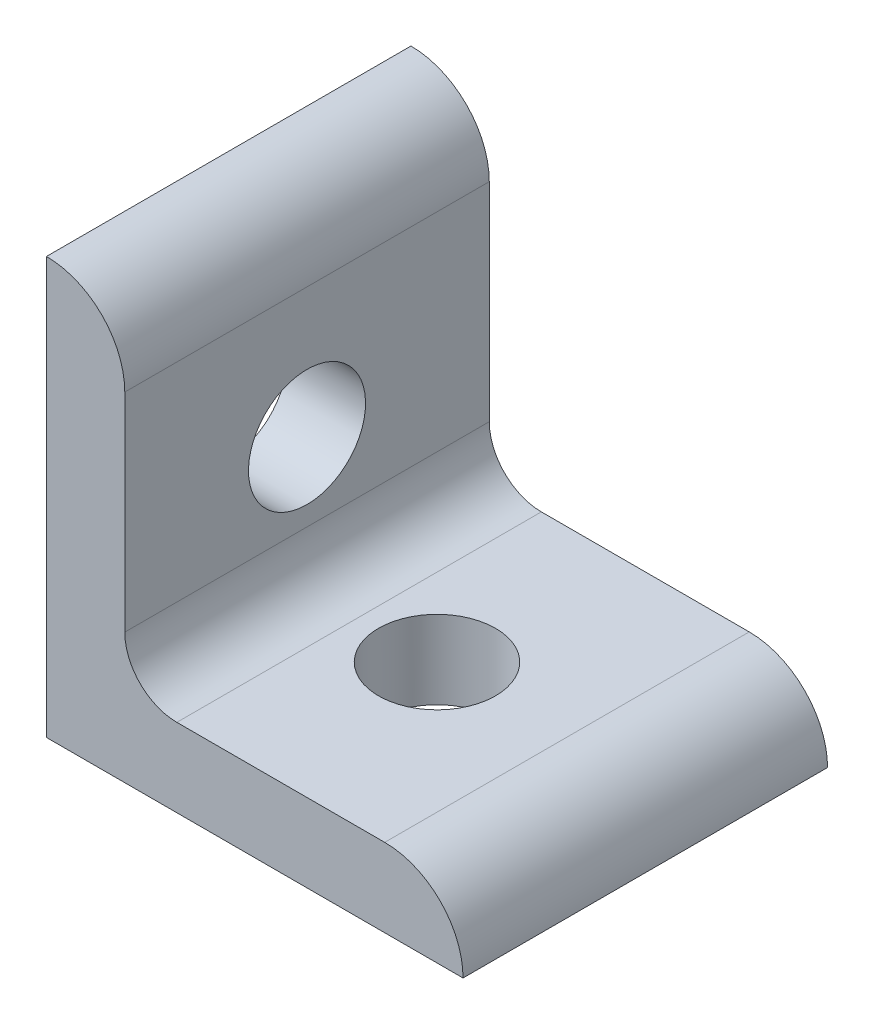
ISO-10303-21;
HEADER;
FILE_DESCRIPTION(('STEP AP214'),'2;1');
FILE_NAME('part.step','',(''),(''),'','','');
FILE_SCHEMA(('AUTOMOTIVE_DESIGN { 1 0 10303 214 1 1 1 1 }'));
ENDSEC;
DATA;
#1=APPLICATION_CONTEXT('core data for automotive mechanical design processes');
#2=APPLICATION_PROTOCOL_DEFINITION('international standard','automotive_design',2000,#1);
#3=PRODUCT_CONTEXT('',#1,'mechanical');
#4=PRODUCT('Part','Part','',(#3));
#5=PRODUCT_RELATED_PRODUCT_CATEGORY('part','',(#4));
#6=PRODUCT_DEFINITION_FORMATION('','',#4);
#7=PRODUCT_DEFINITION_CONTEXT('part definition',#1,'design');
#8=PRODUCT_DEFINITION('design','',#6,#7);
#9=PRODUCT_DEFINITION_SHAPE('','',#8);
#10=(LENGTH_UNIT() NAMED_UNIT(*) SI_UNIT(.MILLI.,.METRE.));
#11=(NAMED_UNIT(*) PLANE_ANGLE_UNIT() SI_UNIT($,.RADIAN.));
#12=(NAMED_UNIT(*) SI_UNIT($,.STERADIAN.) SOLID_ANGLE_UNIT());
#13=UNCERTAINTY_MEASURE_WITH_UNIT(LENGTH_MEASURE(1.E-05),#10,'distance_accuracy_value','');
#14=(GEOMETRIC_REPRESENTATION_CONTEXT(3) GLOBAL_UNCERTAINTY_ASSIGNED_CONTEXT((#13)) GLOBAL_UNIT_ASSIGNED_CONTEXT((#10,
#11,#12)) REPRESENTATION_CONTEXT('',''));
#15=CARTESIAN_POINT('',(0.,0.,0.));
#16=DIRECTION('',(0.,0.,1.));
#17=DIRECTION('',(1.,0.,0.));
#18=AXIS2_PLACEMENT_3D('',#15,#16,#17);
#19=CARTESIAN_POINT('',(4.7752,20.6248,11.1125));
#20=DIRECTION('',(-1.,0.,0.));
#21=DIRECTION('',(0.,-1.,0.));
#22=AXIS2_PLACEMENT_3D('',#19,#20,#21);
#23=PLANE('',#22);
#24=DIRECTION('',(0.,1.,0.));
#25=VECTOR('',#24,1.);
#26=CARTESIAN_POINT('',(4.7752,20.6248,-11.1125));
#27=LINE('',#26,#25);
#28=CARTESIAN_POINT('',(4.7752,7.9502,-11.1125));
#29=VERTEX_POINT('',#28);
#30=CARTESIAN_POINT('',(4.7752,20.6248,-11.1125));
#31=VERTEX_POINT('',#30);
#32=EDGE_CURVE('E114',#29,#31,#27,.T.);
#33=ORIENTED_EDGE('',*,*,#32,.T.);
#34=DIRECTION('',(0.,0.,-1.));
#35=VECTOR('',#34,1.);
#36=CARTESIAN_POINT('',(4.7752,20.6248,11.1125));
#37=LINE('',#36,#35);
#38=CARTESIAN_POINT('',(4.7752,20.6248,11.1125));
#39=VERTEX_POINT('',#38);
#40=EDGE_CURVE('E111',#39,#31,#37,.T.);
#41=ORIENTED_EDGE('',*,*,#40,.F.);
#42=DIRECTION('',(0.,1.,0.));
#43=VECTOR('',#42,1.);
#44=CARTESIAN_POINT('',(4.7752,20.6248,11.1125));
#45=LINE('',#44,#43);
#46=CARTESIAN_POINT('',(4.7752,7.9502,11.1125));
#47=VERTEX_POINT('',#46);
#48=EDGE_CURVE('E100',#47,#39,#45,.T.);
#49=ORIENTED_EDGE('',*,*,#48,.F.);
#50=DIRECTION('',(0.,0.,-1.));
#51=VECTOR('',#50,1.);
#52=CARTESIAN_POINT('',(4.7752,7.9502,11.1125));
#53=LINE('',#52,#51);
#54=EDGE_CURVE('E115',#47,#29,#53,.T.);
#55=ORIENTED_EDGE('',*,*,#54,.T.);
#56=EDGE_LOOP('',(#33,#41,#49,#55));
#57=FACE_BOUND('',#56,.T.);
#58=CARTESIAN_POINT('',(4.7752,12.7,0.));
#59=DIRECTION('',(-1.,0.,0.));
#60=DIRECTION('',(0.,-1.,0.));
#61=AXIS2_PLACEMENT_3D('',#58,#59,#60);
#62=CIRCLE('',#61,3.5687);
#63=CARTESIAN_POINT('',(4.7752,9.1313,0.));
#64=VERTEX_POINT('',#63);
#65=EDGE_CURVE('E164',#64,#64,#62,.F.);
#66=ORIENTED_EDGE('',*,*,#65,.F.);
#67=EDGE_LOOP('',(#66));
#68=FACE_BOUND('',#67,.T.);
#69=ADVANCED_FACE('F32',(#57,#68),#23,.F.);
#70=CARTESIAN_POINT('',(0.,0.,11.1125));
#71=DIRECTION('',(1.,0.,0.));
#72=DIRECTION('',(0.,0.,-1.));
#73=AXIS2_PLACEMENT_3D('',#70,#71,#72);
#74=PLANE('',#73);
#75=DIRECTION('',(0.,-1.,0.));
#76=VECTOR('',#75,1.);
#77=CARTESIAN_POINT('',(0.,0.,-11.1125));
#78=LINE('',#77,#76);
#79=CARTESIAN_POINT('',(0.,25.4,-11.1125));
#80=VERTEX_POINT('',#79);
#81=CARTESIAN_POINT('',(0.,0.,-11.1125));
#82=VERTEX_POINT('',#81);
#83=EDGE_CURVE('E82',#80,#82,#78,.T.);
#84=ORIENTED_EDGE('',*,*,#83,.T.);
#85=DIRECTION('',(0.,0.,-1.));
#86=VECTOR('',#85,1.);
#87=CARTESIAN_POINT('',(0.,0.,11.1125));
#88=LINE('',#87,#86);
#89=CARTESIAN_POINT('',(0.,0.,11.1125));
#90=VERTEX_POINT('',#89);
#91=EDGE_CURVE('E120',#90,#82,#88,.T.);
#92=ORIENTED_EDGE('',*,*,#91,.F.);
#93=DIRECTION('',(0.,-1.,0.));
#94=VECTOR('',#93,1.);
#95=CARTESIAN_POINT('',(0.,0.,11.1125));
#96=LINE('',#95,#94);
#97=CARTESIAN_POINT('',(0.,25.4,11.1125));
#98=VERTEX_POINT('',#97);
#99=EDGE_CURVE('E50',#98,#90,#96,.T.);
#100=ORIENTED_EDGE('',*,*,#99,.F.);
#101=DIRECTION('',(0.,0.,-1.));
#102=VECTOR('',#101,1.);
#103=CARTESIAN_POINT('',(0.,25.4,11.1125));
#104=LINE('',#103,#102);
#105=EDGE_CURVE('E116',#98,#80,#104,.T.);
#106=ORIENTED_EDGE('',*,*,#105,.T.);
#107=EDGE_LOOP('',(#84,#92,#100,#106));
#108=FACE_BOUND('',#107,.T.);
#109=CARTESIAN_POINT('',(0.,12.7,0.));
#110=DIRECTION('',(1.,0.,0.));
#111=DIRECTION('',(0.,0.,-1.));
#112=AXIS2_PLACEMENT_3D('',#109,#110,#111);
#113=CIRCLE('',#112,3.5687);
#114=CARTESIAN_POINT('',(0.,12.7,-3.5687));
#115=VERTEX_POINT('',#114);
#116=EDGE_CURVE('E167',#115,#115,#113,.T.);
#117=ORIENTED_EDGE('',*,*,#116,.T.);
#118=EDGE_LOOP('',(#117));
#119=FACE_BOUND('',#118,.T.);
#120=ADVANCED_FACE('F171',(#108,#119),#74,.F.);
#121=CARTESIAN_POINT('',(25.4,0.,11.1125));
#122=DIRECTION('',(0.,1.,0.));
#123=DIRECTION('',(-1.,0.,0.));
#124=AXIS2_PLACEMENT_3D('',#121,#122,#123);
#125=PLANE('',#124);
#126=DIRECTION('',(1.,0.,0.));
#127=VECTOR('',#126,1.);
#128=CARTESIAN_POINT('',(25.4,0.,-11.1125));
#129=LINE('',#128,#127);
#130=CARTESIAN_POINT('',(25.4,0.,-11.1125));
#131=VERTEX_POINT('',#130);
#132=EDGE_CURVE('E124',#82,#131,#129,.T.);
#133=ORIENTED_EDGE('',*,*,#132,.T.);
#134=DIRECTION('',(0.,0.,-1.));
#135=VECTOR('',#134,1.);
#136=CARTESIAN_POINT('',(25.4,0.,11.1125));
#137=LINE('',#136,#135);
#138=CARTESIAN_POINT('',(25.4,0.,11.1125));
#139=VERTEX_POINT('',#138);
#140=EDGE_CURVE('E11',#139,#131,#137,.T.);
#141=ORIENTED_EDGE('',*,*,#140,.F.);
#142=DIRECTION('',(1.,0.,0.));
#143=VECTOR('',#142,1.);
#144=CARTESIAN_POINT('',(25.4,0.,11.1125));
#145=LINE('',#144,#143);
#146=EDGE_CURVE('E136',#90,#139,#145,.T.);
#147=ORIENTED_EDGE('',*,*,#146,.F.);
#148=ORIENTED_EDGE('',*,*,#91,.T.);
#149=EDGE_LOOP('',(#133,#141,#147,#148));
#150=FACE_BOUND('',#149,.T.);
#151=CARTESIAN_POINT('',(12.7,0.,0.));
#152=DIRECTION('',(0.,1.,0.));
#153=DIRECTION('',(0.,0.,1.));
#154=AXIS2_PLACEMENT_3D('',#151,#152,#153);
#155=CIRCLE('',#154,3.5687);
#156=CARTESIAN_POINT('',(12.7,0.,3.5687));
#157=VERTEX_POINT('',#156);
#158=EDGE_CURVE('E161',#157,#157,#155,.T.);
#159=ORIENTED_EDGE('',*,*,#158,.T.);
#160=EDGE_LOOP('',(#159));
#161=FACE_BOUND('',#160,.T.);
#162=ADVANCED_FACE('F34',(#150,#161),#125,.F.);
#163=CARTESIAN_POINT('',(7.9502,4.7752,11.1125));
#164=DIRECTION('',(0.,-1.,0.));
#165=DIRECTION('',(0.,0.,-1.));
#166=AXIS2_PLACEMENT_3D('',#163,#164,#165);
#167=PLANE('',#166);
#168=DIRECTION('',(-1.,0.,0.));
#169=VECTOR('',#168,1.);
#170=CARTESIAN_POINT('',(7.9502,4.7752,-11.1125));
#171=LINE('',#170,#169);
#172=CARTESIAN_POINT('',(20.6248,4.7752,-11.1125));
#173=VERTEX_POINT('',#172);
#174=CARTESIAN_POINT('',(7.9502,4.7752,-11.1125));
#175=VERTEX_POINT('',#174);
#176=EDGE_CURVE('E129',#173,#175,#171,.T.);
#177=ORIENTED_EDGE('',*,*,#176,.T.);
#178=DIRECTION('',(0.,0.,-1.));
#179=VECTOR('',#178,1.);
#180=CARTESIAN_POINT('',(7.9502,4.7752,11.1125));
#181=LINE('',#180,#179);
#182=CARTESIAN_POINT('',(7.9502,4.7752,11.1125));
#183=VERTEX_POINT('',#182);
#184=EDGE_CURVE('E140',#183,#175,#181,.T.);
#185=ORIENTED_EDGE('',*,*,#184,.F.);
#186=DIRECTION('',(-1.,0.,0.));
#187=VECTOR('',#186,1.);
#188=CARTESIAN_POINT('',(7.9502,4.7752,11.1125));
#189=LINE('',#188,#187);
#190=CARTESIAN_POINT('',(20.6248,4.7752,11.1125));
#191=VERTEX_POINT('',#190);
#192=EDGE_CURVE('E150',#191,#183,#189,.T.);
#193=ORIENTED_EDGE('',*,*,#192,.F.);
#194=DIRECTION('',(0.,0.,-1.));
#195=VECTOR('',#194,1.);
#196=CARTESIAN_POINT('',(20.6248,4.7752,11.1125));
#197=LINE('',#196,#195);
#198=EDGE_CURVE('E42',#191,#173,#197,.T.);
#199=ORIENTED_EDGE('',*,*,#198,.T.);
#200=EDGE_LOOP('',(#177,#185,#193,#199));
#201=FACE_BOUND('',#200,.T.);
#202=CARTESIAN_POINT('',(12.7,4.7752,0.));
#203=DIRECTION('',(0.,-1.,0.));
#204=DIRECTION('',(0.,0.,-1.));
#205=AXIS2_PLACEMENT_3D('',#202,#203,#204);
#206=CIRCLE('',#205,3.5687);
#207=CARTESIAN_POINT('',(12.7,4.7752,-3.5687));
#208=VERTEX_POINT('',#207);
#209=EDGE_CURVE('E36',#208,#208,#206,.F.);
#210=ORIENTED_EDGE('',*,*,#209,.F.);
#211=EDGE_LOOP('',(#210));
#212=FACE_BOUND('',#211,.T.);
#213=ADVANCED_FACE('F147',(#201,#212),#167,.F.);
#214=CARTESIAN_POINT('',(20.6248,0.,11.1125));
#215=DIRECTION('',(0.,0.,-1.));
#216=DIRECTION('',(-1.,0.,0.));
#217=AXIS2_PLACEMENT_3D('',#214,#215,#216);
#218=CYLINDRICAL_SURFACE('',#217,4.7752);
#219=CARTESIAN_POINT('',(20.6248,0.,-11.1125));
#220=DIRECTION('',(0.,0.,1.));
#221=DIRECTION('',(1.,0.,0.));
#222=AXIS2_PLACEMENT_3D('',#219,#220,#221);
#223=CIRCLE('',#222,4.7752);
#224=EDGE_CURVE('E127',#131,#173,#223,.T.);
#225=ORIENTED_EDGE('',*,*,#224,.T.);
#226=ORIENTED_EDGE('',*,*,#198,.F.);
#227=CARTESIAN_POINT('',(20.6248,0.,11.1125));
#228=DIRECTION('',(0.,0.,1.));
#229=DIRECTION('',(1.,0.,0.));
#230=AXIS2_PLACEMENT_3D('',#227,#228,#229);
#231=CIRCLE('',#230,4.7752);
#232=EDGE_CURVE('E90',#139,#191,#231,.T.);
#233=ORIENTED_EDGE('',*,*,#232,.F.);
#234=ORIENTED_EDGE('',*,*,#140,.T.);
#235=EDGE_LOOP('',(#225,#226,#233,#234));
#236=FACE_BOUND('',#235,.T.);
#237=ADVANCED_FACE('F189',(#236),#218,.T.);
#238=CARTESIAN_POINT('',(7.9502,7.9502,11.1125));
#239=DIRECTION('',(0.,0.,-1.));
#240=DIRECTION('',(-1.,0.,0.));
#241=AXIS2_PLACEMENT_3D('',#238,#239,#240);
#242=CYLINDRICAL_SURFACE('',#241,3.175);
#243=CARTESIAN_POINT('',(7.9502,7.9502,-11.1125));
#244=DIRECTION('',(0.,0.,-1.));
#245=DIRECTION('',(1.,0.,0.));
#246=AXIS2_PLACEMENT_3D('',#243,#244,#245);
#247=CIRCLE('',#246,3.175);
#248=EDGE_CURVE('E131',#175,#29,#247,.T.);
#249=ORIENTED_EDGE('',*,*,#248,.T.);
#250=ORIENTED_EDGE('',*,*,#54,.F.);
#251=CARTESIAN_POINT('',(7.9502,7.9502,11.1125));
#252=DIRECTION('',(0.,0.,-1.));
#253=DIRECTION('',(1.,0.,0.));
#254=AXIS2_PLACEMENT_3D('',#251,#252,#253);
#255=CIRCLE('',#254,3.175);
#256=EDGE_CURVE('E106',#183,#47,#255,.T.);
#257=ORIENTED_EDGE('',*,*,#256,.F.);
#258=ORIENTED_EDGE('',*,*,#184,.T.);
#259=EDGE_LOOP('',(#249,#250,#257,#258));
#260=FACE_BOUND('',#259,.T.);
#261=ADVANCED_FACE('F156',(#260),#242,.F.);
#262=CARTESIAN_POINT('',(0.,20.6248,11.1125));
#263=DIRECTION('',(0.,0.,-1.));
#264=DIRECTION('',(-1.,0.,0.));
#265=AXIS2_PLACEMENT_3D('',#262,#263,#264);
#266=CYLINDRICAL_SURFACE('',#265,4.7752);
#267=CARTESIAN_POINT('',(0.,20.6248,-11.1125));
#268=DIRECTION('',(0.,0.,1.));
#269=DIRECTION('',(1.,0.,0.));
#270=AXIS2_PLACEMENT_3D('',#267,#268,#269);
#271=CIRCLE('',#270,4.7752);
#272=EDGE_CURVE('E76',#31,#80,#271,.T.);
#273=ORIENTED_EDGE('',*,*,#272,.T.);
#274=ORIENTED_EDGE('',*,*,#105,.F.);
#275=CARTESIAN_POINT('',(0.,20.6248,11.1125));
#276=DIRECTION('',(0.,0.,1.));
#277=DIRECTION('',(1.,0.,0.));
#278=AXIS2_PLACEMENT_3D('',#275,#276,#277);
#279=CIRCLE('',#278,4.7752);
#280=EDGE_CURVE('E104',#39,#98,#279,.T.);
#281=ORIENTED_EDGE('',*,*,#280,.F.);
#282=ORIENTED_EDGE('',*,*,#40,.T.);
#283=EDGE_LOOP('',(#273,#274,#281,#282));
#284=FACE_BOUND('',#283,.T.);
#285=ADVANCED_FACE('F118',(#284),#266,.T.);
#286=CARTESIAN_POINT('',(0.,20.6248,11.1125));
#287=DIRECTION('',(0.,0.,1.));
#288=DIRECTION('',(1.,0.,0.));
#289=AXIS2_PLACEMENT_3D('',#286,#287,#288);
#290=PLANE('',#289);
#291=ORIENTED_EDGE('',*,*,#146,.T.);
#292=ORIENTED_EDGE('',*,*,#232,.T.);
#293=ORIENTED_EDGE('',*,*,#192,.T.);
#294=ORIENTED_EDGE('',*,*,#256,.T.);
#295=ORIENTED_EDGE('',*,*,#48,.T.);
#296=ORIENTED_EDGE('',*,*,#280,.T.);
#297=ORIENTED_EDGE('',*,*,#99,.T.);
#298=EDGE_LOOP('',(#291,#292,#293,#294,#295,#296,#297));
#299=FACE_BOUND('',#298,.T.);
#300=ADVANCED_FACE('F102',(#299),#290,.T.);
#301=CARTESIAN_POINT('',(0.,20.6248,-11.1125));
#302=DIRECTION('',(0.,0.,1.));
#303=DIRECTION('',(1.,0.,0.));
#304=AXIS2_PLACEMENT_3D('',#301,#302,#303);
#305=PLANE('',#304);
#306=ORIENTED_EDGE('',*,*,#132,.F.);
#307=ORIENTED_EDGE('',*,*,#83,.F.);
#308=ORIENTED_EDGE('',*,*,#272,.F.);
#309=ORIENTED_EDGE('',*,*,#32,.F.);
#310=ORIENTED_EDGE('',*,*,#248,.F.);
#311=ORIENTED_EDGE('',*,*,#176,.F.);
#312=ORIENTED_EDGE('',*,*,#224,.F.);
#313=EDGE_LOOP('',(#306,#307,#308,#309,#310,#311,#312));
#314=FACE_BOUND('',#313,.T.);
#315=ADVANCED_FACE('F154',(#314),#305,.F.);
#316=CARTESIAN_POINT('',(12.7,25.4,0.));
#317=DIRECTION('',(0.,-1.,0.));
#318=DIRECTION('',(0.,0.,-1.));
#319=AXIS2_PLACEMENT_3D('',#316,#317,#318);
#320=CYLINDRICAL_SURFACE('',#319,3.5687);
#321=ORIENTED_EDGE('',*,*,#158,.F.);
#322=EDGE_LOOP('',(#321));
#323=FACE_BOUND('',#322,.T.);
#324=ORIENTED_EDGE('',*,*,#209,.T.);
#325=EDGE_LOOP('',(#324));
#326=FACE_BOUND('',#325,.T.);
#327=ADVANCED_FACE('F176',(#323,#326),#320,.F.);
#328=CARTESIAN_POINT('',(25.4,12.7,0.));
#329=DIRECTION('',(-1.,0.,0.));
#330=DIRECTION('',(0.,0.,1.));
#331=AXIS2_PLACEMENT_3D('',#328,#329,#330);
#332=CYLINDRICAL_SURFACE('',#331,3.5687);
#333=ORIENTED_EDGE('',*,*,#116,.F.);
#334=EDGE_LOOP('',(#333));
#335=FACE_BOUND('',#334,.T.);
#336=ORIENTED_EDGE('',*,*,#65,.T.);
#337=EDGE_LOOP('',(#336));
#338=FACE_BOUND('',#337,.T.);
#339=ADVANCED_FACE('F173',(#335,#338),#332,.F.);
#340=CLOSED_SHELL('',(#69,#120,#162,#213,#237,#261,#285,#300,#315,#327,#339));
#341=MANIFOLD_SOLID_BREP('B2',#340);
#342=ADVANCED_BREP_SHAPE_REPRESENTATION('',(#18,#341),#14);
#343=SHAPE_DEFINITION_REPRESENTATION(#9,#342);
ENDSEC;
END-ISO-10303-21;
